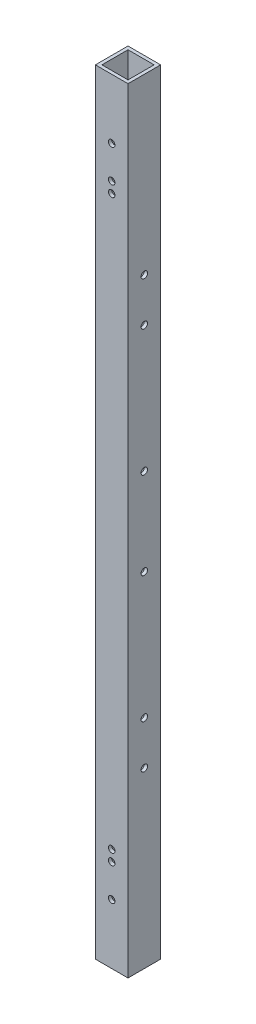
ISO-10303-21;
HEADER;
FILE_DESCRIPTION(('STEP AP214'),'2;1');
FILE_NAME('part.step','',(''),(''),'','','');
FILE_SCHEMA(('AUTOMOTIVE_DESIGN { 1 0 10303 214 1 1 1 1 }'));
ENDSEC;
DATA;
#1=APPLICATION_CONTEXT('core data for automotive mechanical design processes');
#2=APPLICATION_PROTOCOL_DEFINITION('international standard','automotive_design',2000,#1);
#3=PRODUCT_CONTEXT('',#1,'mechanical');
#4=PRODUCT('Part','Part','',(#3));
#5=PRODUCT_RELATED_PRODUCT_CATEGORY('part','',(#4));
#6=PRODUCT_DEFINITION_FORMATION('','',#4);
#7=PRODUCT_DEFINITION_CONTEXT('part definition',#1,'design');
#8=PRODUCT_DEFINITION('design','',#6,#7);
#9=PRODUCT_DEFINITION_SHAPE('','',#8);
#10=(LENGTH_UNIT() NAMED_UNIT(*) SI_UNIT(.MILLI.,.METRE.));
#11=(NAMED_UNIT(*) PLANE_ANGLE_UNIT() SI_UNIT($,.RADIAN.));
#12=(NAMED_UNIT(*) SI_UNIT($,.STERADIAN.) SOLID_ANGLE_UNIT());
#13=UNCERTAINTY_MEASURE_WITH_UNIT(LENGTH_MEASURE(1.E-05),#10,'distance_accuracy_value','');
#14=(GEOMETRIC_REPRESENTATION_CONTEXT(3) GLOBAL_UNCERTAINTY_ASSIGNED_CONTEXT((#13)) GLOBAL_UNIT_ASSIGNED_CONTEXT((#10,
#11,#12)) REPRESENTATION_CONTEXT('',''));
#15=CARTESIAN_POINT('',(0.,0.,0.));
#16=DIRECTION('',(0.,0.,1.));
#17=DIRECTION('',(1.,0.,0.));
#18=AXIS2_PLACEMENT_3D('',#15,#16,#17);
#19=CARTESIAN_POINT('',(0.,356.,0.));
#20=DIRECTION('',(0.,1.,0.));
#21=DIRECTION('',(0.,0.,1.));
#22=AXIS2_PLACEMENT_3D('',#19,#20,#21);
#23=PLANE('',#22);
#24=DIRECTION('',(0.,0.,1.));
#25=VECTOR('',#24,1.);
#26=CARTESIAN_POINT('',(0.,356.,0.));
#27=LINE('',#26,#25);
#28=CARTESIAN_POINT('',(0.,356.,-15.));
#29=VERTEX_POINT('',#28);
#30=CARTESIAN_POINT('',(0.,356.,0.));
#31=VERTEX_POINT('',#30);
#32=EDGE_CURVE('E172',#29,#31,#27,.T.);
#33=ORIENTED_EDGE('',*,*,#32,.T.);
#34=DIRECTION('',(1.,0.,0.));
#35=VECTOR('',#34,1.);
#36=CARTESIAN_POINT('',(0.,356.,0.));
#37=LINE('',#36,#35);
#38=CARTESIAN_POINT('',(15.,356.,0.));
#39=VERTEX_POINT('',#38);
#40=EDGE_CURVE('E175',#31,#39,#37,.T.);
#41=ORIENTED_EDGE('',*,*,#40,.T.);
#42=DIRECTION('',(0.,0.,-1.));
#43=VECTOR('',#42,1.);
#44=CARTESIAN_POINT('',(15.,356.,0.));
#45=LINE('',#44,#43);
#46=CARTESIAN_POINT('',(15.,356.,-15.));
#47=VERTEX_POINT('',#46);
#48=EDGE_CURVE('E178',#39,#47,#45,.T.);
#49=ORIENTED_EDGE('',*,*,#48,.T.);
#50=DIRECTION('',(-1.,0.,0.));
#51=VECTOR('',#50,1.);
#52=CARTESIAN_POINT('',(0.,356.,-15.));
#53=LINE('',#52,#51);
#54=EDGE_CURVE('E180',#47,#29,#53,.T.);
#55=ORIENTED_EDGE('',*,*,#54,.T.);
#56=EDGE_LOOP('',(#33,#41,#49,#55));
#57=FACE_BOUND('',#56,.T.);
#58=DIRECTION('',(1.,0.,0.));
#59=VECTOR('',#58,1.);
#60=CARTESIAN_POINT('',(0.,356.,-1.5));
#61=LINE('',#60,#59);
#62=CARTESIAN_POINT('',(1.5,356.,-1.5));
#63=VERTEX_POINT('',#62);
#64=CARTESIAN_POINT('',(13.5,356.,-1.5));
#65=VERTEX_POINT('',#64);
#66=EDGE_CURVE('E142',#63,#65,#61,.T.);
#67=ORIENTED_EDGE('',*,*,#66,.F.);
#68=DIRECTION('',(0.,0.,1.));
#69=VECTOR('',#68,1.);
#70=CARTESIAN_POINT('',(1.5,356.,0.));
#71=LINE('',#70,#69);
#72=CARTESIAN_POINT('',(1.5,356.,-13.5));
#73=VERTEX_POINT('',#72);
#74=EDGE_CURVE('E134',#73,#63,#71,.T.);
#75=ORIENTED_EDGE('',*,*,#74,.F.);
#76=DIRECTION('',(-1.,0.,0.));
#77=VECTOR('',#76,1.);
#78=CARTESIAN_POINT('',(0.,356.,-13.5));
#79=LINE('',#78,#77);
#80=CARTESIAN_POINT('',(13.5,356.,-13.5));
#81=VERTEX_POINT('',#80);
#82=EDGE_CURVE('E156',#81,#73,#79,.T.);
#83=ORIENTED_EDGE('',*,*,#82,.F.);
#84=DIRECTION('',(0.,0.,-1.));
#85=VECTOR('',#84,1.);
#86=CARTESIAN_POINT('',(13.5,356.,0.));
#87=LINE('',#86,#85);
#88=EDGE_CURVE('E154',#65,#81,#87,.T.);
#89=ORIENTED_EDGE('',*,*,#88,.F.);
#90=EDGE_LOOP('',(#67,#75,#83,#89));
#91=FACE_BOUND('',#90,.T.);
#92=ADVANCED_FACE('F67',(#57,#91),#23,.T.);
#93=CARTESIAN_POINT('',(0.,0.,0.));
#94=DIRECTION('',(0.,1.,0.));
#95=DIRECTION('',(0.,0.,1.));
#96=AXIS2_PLACEMENT_3D('',#93,#94,#95);
#97=PLANE('',#96);
#98=DIRECTION('',(0.,0.,1.));
#99=VECTOR('',#98,1.);
#100=CARTESIAN_POINT('',(0.,0.,0.));
#101=LINE('',#100,#99);
#102=CARTESIAN_POINT('',(0.,0.,-15.));
#103=VERTEX_POINT('',#102);
#104=CARTESIAN_POINT('',(0.,0.,0.));
#105=VERTEX_POINT('',#104);
#106=EDGE_CURVE('E150',#103,#105,#101,.T.);
#107=ORIENTED_EDGE('',*,*,#106,.F.);
#108=DIRECTION('',(-1.,0.,0.));
#109=VECTOR('',#108,1.);
#110=CARTESIAN_POINT('',(0.,0.,-15.));
#111=LINE('',#110,#109);
#112=CARTESIAN_POINT('',(15.,0.,-15.));
#113=VERTEX_POINT('',#112);
#114=EDGE_CURVE('E176',#113,#103,#111,.T.);
#115=ORIENTED_EDGE('',*,*,#114,.F.);
#116=DIRECTION('',(0.,0.,-1.));
#117=VECTOR('',#116,1.);
#118=CARTESIAN_POINT('',(15.,0.,0.));
#119=LINE('',#118,#117);
#120=CARTESIAN_POINT('',(15.,0.,0.));
#121=VERTEX_POINT('',#120);
#122=EDGE_CURVE('E187',#121,#113,#119,.T.);
#123=ORIENTED_EDGE('',*,*,#122,.F.);
#124=DIRECTION('',(1.,0.,0.));
#125=VECTOR('',#124,1.);
#126=CARTESIAN_POINT('',(0.,0.,0.));
#127=LINE('',#126,#125);
#128=EDGE_CURVE('E185',#105,#121,#127,.T.);
#129=ORIENTED_EDGE('',*,*,#128,.F.);
#130=EDGE_LOOP('',(#107,#115,#123,#129));
#131=FACE_BOUND('',#130,.T.);
#132=DIRECTION('',(0.,0.,1.));
#133=VECTOR('',#132,1.);
#134=CARTESIAN_POINT('',(1.5,0.,0.));
#135=LINE('',#134,#133);
#136=CARTESIAN_POINT('',(1.5,0.,-13.5));
#137=VERTEX_POINT('',#136);
#138=CARTESIAN_POINT('',(1.5,0.,-1.5));
#139=VERTEX_POINT('',#138);
#140=EDGE_CURVE('E92',#137,#139,#135,.T.);
#141=ORIENTED_EDGE('',*,*,#140,.T.);
#142=DIRECTION('',(1.,0.,0.));
#143=VECTOR('',#142,1.);
#144=CARTESIAN_POINT('',(0.,0.,-1.5));
#145=LINE('',#144,#143);
#146=CARTESIAN_POINT('',(13.5,0.,-1.5));
#147=VERTEX_POINT('',#146);
#148=EDGE_CURVE('E149',#139,#147,#145,.T.);
#149=ORIENTED_EDGE('',*,*,#148,.T.);
#150=DIRECTION('',(0.,0.,-1.));
#151=VECTOR('',#150,1.);
#152=CARTESIAN_POINT('',(13.5,0.,0.));
#153=LINE('',#152,#151);
#154=CARTESIAN_POINT('',(13.5,0.,-13.5));
#155=VERTEX_POINT('',#154);
#156=EDGE_CURVE('E164',#147,#155,#153,.T.);
#157=ORIENTED_EDGE('',*,*,#156,.T.);
#158=DIRECTION('',(-1.,0.,0.));
#159=VECTOR('',#158,1.);
#160=CARTESIAN_POINT('',(0.,0.,-13.5));
#161=LINE('',#160,#159);
#162=EDGE_CURVE('E143',#155,#137,#161,.T.);
#163=ORIENTED_EDGE('',*,*,#162,.T.);
#164=EDGE_LOOP('',(#141,#149,#157,#163));
#165=FACE_BOUND('',#164,.T.);
#166=ADVANCED_FACE('F341',(#131,#165),#97,.F.);
#167=CARTESIAN_POINT('',(0.,356.,0.));
#168=DIRECTION('',(1.,0.,0.));
#169=DIRECTION('',(0.,0.,-1.));
#170=AXIS2_PLACEMENT_3D('',#167,#168,#169);
#171=PLANE('',#170);
#172=CARTESIAN_POINT('',(0.,276.148,-7.50000000000833));
#173=DIRECTION('',(1.,0.,0.));
#174=DIRECTION('',(0.,0.,-1.));
#175=AXIS2_PLACEMENT_3D('',#172,#173,#174);
#176=CIRCLE('',#175,1.49999999999173);
#177=CARTESIAN_POINT('',(0.,276.148,-9.00000000000006));
#178=VERTEX_POINT('',#177);
#179=EDGE_CURVE('E225',#178,#178,#176,.T.);
#180=ORIENTED_EDGE('',*,*,#179,.T.);
#181=EDGE_LOOP('',(#180));
#182=FACE_BOUND('',#181,.T.);
#183=CARTESIAN_POINT('',(0.,256.148,-7.50000000000833));
#184=DIRECTION('',(1.,0.,0.));
#185=DIRECTION('',(0.,0.,-1.));
#186=AXIS2_PLACEMENT_3D('',#183,#184,#185);
#187=CIRCLE('',#186,1.49999999999152);
#188=CARTESIAN_POINT('',(0.,256.148,-8.99999999999985));
#189=VERTEX_POINT('',#188);
#190=EDGE_CURVE('E429',#189,#189,#187,.T.);
#191=ORIENTED_EDGE('',*,*,#190,.T.);
#192=EDGE_LOOP('',(#191));
#193=FACE_BOUND('',#192,.T.);
#194=CARTESIAN_POINT('',(0.,198.,-7.50000000000833));
#195=DIRECTION('',(1.,0.,0.));
#196=DIRECTION('',(0.,0.,-1.));
#197=AXIS2_PLACEMENT_3D('',#194,#195,#196);
#198=CIRCLE('',#197,1.5);
#199=CARTESIAN_POINT('',(0.,198.,-9.00000000000833));
#200=VERTEX_POINT('',#199);
#201=EDGE_CURVE('E433',#200,#200,#198,.T.);
#202=ORIENTED_EDGE('',*,*,#201,.T.);
#203=EDGE_LOOP('',(#202));
#204=FACE_BOUND('',#203,.T.);
#205=CARTESIAN_POINT('',(0.,158.,-7.50000000000833));
#206=DIRECTION('',(1.,0.,0.));
#207=DIRECTION('',(0.,0.,-1.));
#208=AXIS2_PLACEMENT_3D('',#205,#206,#207);
#209=CIRCLE('',#208,1.5);
#210=CARTESIAN_POINT('',(0.,158.,-9.00000000000833));
#211=VERTEX_POINT('',#210);
#212=EDGE_CURVE('E437',#211,#211,#209,.T.);
#213=ORIENTED_EDGE('',*,*,#212,.T.);
#214=EDGE_LOOP('',(#213));
#215=FACE_BOUND('',#214,.T.);
#216=CARTESIAN_POINT('',(0.,99.8520000000001,-7.50000000000833));
#217=DIRECTION('',(1.,0.,0.));
#218=DIRECTION('',(0.,0.,-1.));
#219=AXIS2_PLACEMENT_3D('',#216,#217,#218);
#220=CIRCLE('',#219,1.50000000000754);
#221=CARTESIAN_POINT('',(0.,99.8520000000001,-9.00000000001586));
#222=VERTEX_POINT('',#221);
#223=EDGE_CURVE('E391',#222,#222,#220,.T.);
#224=ORIENTED_EDGE('',*,*,#223,.T.);
#225=EDGE_LOOP('',(#224));
#226=FACE_BOUND('',#225,.T.);
#227=CARTESIAN_POINT('',(0.,79.8520000000001,-7.50000000000833));
#228=DIRECTION('',(1.,0.,0.));
#229=DIRECTION('',(0.,0.,-1.));
#230=AXIS2_PLACEMENT_3D('',#227,#228,#229);
#231=CIRCLE('',#230,1.50000000000775);
#232=CARTESIAN_POINT('',(0.,79.8520000000001,-9.00000000001608));
#233=VERTEX_POINT('',#232);
#234=EDGE_CURVE('E392',#233,#233,#231,.T.);
#235=ORIENTED_EDGE('',*,*,#234,.T.);
#236=EDGE_LOOP('',(#235));
#237=FACE_BOUND('',#236,.T.);
#238=ORIENTED_EDGE('',*,*,#106,.T.);
#239=DIRECTION('',(0.,-1.,0.));
#240=VECTOR('',#239,1.);
#241=CARTESIAN_POINT('',(0.,356.,0.));
#242=LINE('',#241,#240);
#243=EDGE_CURVE('E12',#31,#105,#242,.T.);
#244=ORIENTED_EDGE('',*,*,#243,.F.);
#245=ORIENTED_EDGE('',*,*,#32,.F.);
#246=DIRECTION('',(0.,-1.,0.));
#247=VECTOR('',#246,1.);
#248=CARTESIAN_POINT('',(0.,356.,-15.));
#249=LINE('',#248,#247);
#250=EDGE_CURVE('E182',#29,#103,#249,.T.);
#251=ORIENTED_EDGE('',*,*,#250,.T.);
#252=EDGE_LOOP('',(#238,#244,#245,#251));
#253=FACE_BOUND('',#252,.T.);
#254=ADVANCED_FACE('F69',(#182,#193,#204,#215,#226,#237,#253),#171,.F.);
#255=CARTESIAN_POINT('',(0.,356.,0.));
#256=DIRECTION('',(0.,0.,-1.));
#257=DIRECTION('',(-1.,0.,0.));
#258=AXIS2_PLACEMENT_3D('',#255,#256,#257);
#259=PLANE('',#258);
#260=CARTESIAN_POINT('',(7.49999999999842,27.5000000000018,0.));
#261=DIRECTION('',(0.,0.,1.));
#262=DIRECTION('',(1.,0.,0.));
#263=AXIS2_PLACEMENT_3D('',#260,#261,#262);
#264=CIRCLE('',#263,1.5);
#265=CARTESIAN_POINT('',(8.99999999999842,27.5000000000018,0.));
#266=VERTEX_POINT('',#265);
#267=EDGE_CURVE('E257',#266,#266,#264,.T.);
#268=ORIENTED_EDGE('',*,*,#267,.F.);
#269=EDGE_LOOP('',(#268));
#270=FACE_BOUND('',#269,.T.);
#271=CARTESIAN_POINT('',(7.49999999999864,308.499999999998,0.));
#272=DIRECTION('',(0.,0.,1.));
#273=DIRECTION('',(-1.,0.,0.));
#274=AXIS2_PLACEMENT_3D('',#271,#272,#273);
#275=CIRCLE('',#274,1.5);
#276=CARTESIAN_POINT('',(5.99999999999864,308.499999999998,0.));
#277=VERTEX_POINT('',#276);
#278=EDGE_CURVE('E261',#277,#277,#275,.T.);
#279=ORIENTED_EDGE('',*,*,#278,.F.);
#280=EDGE_LOOP('',(#279));
#281=FACE_BOUND('',#280,.T.);
#282=CARTESIAN_POINT('',(7.49999999999977,313.5,0.));
#283=DIRECTION('',(0.,0.,1.));
#284=DIRECTION('',(-1.,0.,0.));
#285=AXIS2_PLACEMENT_3D('',#282,#283,#284);
#286=CIRCLE('',#285,1.5);
#287=CARTESIAN_POINT('',(5.99999999999977,313.5,0.));
#288=VERTEX_POINT('',#287);
#289=EDGE_CURVE('E284',#288,#288,#286,.T.);
#290=ORIENTED_EDGE('',*,*,#289,.F.);
#291=EDGE_LOOP('',(#290));
#292=FACE_BOUND('',#291,.T.);
#293=CARTESIAN_POINT('',(7.49999999999842,328.499999999998,0.));
#294=DIRECTION('',(0.,0.,1.));
#295=DIRECTION('',(-1.,0.,0.));
#296=AXIS2_PLACEMENT_3D('',#293,#294,#295);
#297=CIRCLE('',#296,1.5);
#298=CARTESIAN_POINT('',(5.99999999999842,328.499999999998,0.));
#299=VERTEX_POINT('',#298);
#300=EDGE_CURVE('E278',#299,#299,#297,.T.);
#301=ORIENTED_EDGE('',*,*,#300,.F.);
#302=EDGE_LOOP('',(#301));
#303=FACE_BOUND('',#302,.T.);
#304=CARTESIAN_POINT('',(7.49999999999977,42.5,0.));
#305=DIRECTION('',(0.,0.,1.));
#306=DIRECTION('',(1.,0.,0.));
#307=AXIS2_PLACEMENT_3D('',#304,#305,#306);
#308=CIRCLE('',#307,1.5);
#309=CARTESIAN_POINT('',(8.99999999999977,42.5,0.));
#310=VERTEX_POINT('',#309);
#311=EDGE_CURVE('E272',#310,#310,#308,.T.);
#312=ORIENTED_EDGE('',*,*,#311,.F.);
#313=EDGE_LOOP('',(#312));
#314=FACE_BOUND('',#313,.T.);
#315=CARTESIAN_POINT('',(7.49999999999864,47.5000000000017,0.));
#316=DIRECTION('',(0.,0.,1.));
#317=DIRECTION('',(1.,0.,0.));
#318=AXIS2_PLACEMENT_3D('',#315,#316,#317);
#319=CIRCLE('',#318,1.5);
#320=CARTESIAN_POINT('',(8.99999999999864,47.5000000000017,0.));
#321=VERTEX_POINT('',#320);
#322=EDGE_CURVE('E260',#321,#321,#319,.T.);
#323=ORIENTED_EDGE('',*,*,#322,.F.);
#324=EDGE_LOOP('',(#323));
#325=FACE_BOUND('',#324,.T.);
#326=ORIENTED_EDGE('',*,*,#128,.T.);
#327=DIRECTION('',(0.,-1.,0.));
#328=VECTOR('',#327,1.);
#329=CARTESIAN_POINT('',(15.,356.,0.));
#330=LINE('',#329,#328);
#331=EDGE_CURVE('E76',#39,#121,#330,.T.);
#332=ORIENTED_EDGE('',*,*,#331,.F.);
#333=ORIENTED_EDGE('',*,*,#40,.F.);
#334=ORIENTED_EDGE('',*,*,#243,.T.);
#335=EDGE_LOOP('',(#326,#332,#333,#334));
#336=FACE_BOUND('',#335,.T.);
#337=ADVANCED_FACE('F327',(#270,#281,#292,#303,#314,#325,#336),#259,.F.);
#338=CARTESIAN_POINT('',(15.,356.,0.));
#339=DIRECTION('',(-1.,0.,0.));
#340=DIRECTION('',(0.,0.,1.));
#341=AXIS2_PLACEMENT_3D('',#338,#339,#340);
#342=PLANE('',#341);
#343=CARTESIAN_POINT('',(15.,276.148,-7.50000000000833));
#344=DIRECTION('',(1.,0.,0.));
#345=DIRECTION('',(0.,0.,-1.));
#346=AXIS2_PLACEMENT_3D('',#343,#344,#345);
#347=CIRCLE('',#346,1.49999999999173);
#348=CARTESIAN_POINT('',(15.,276.148,-9.00000000000006));
#349=VERTEX_POINT('',#348);
#350=EDGE_CURVE('E370',#349,#349,#347,.T.);
#351=ORIENTED_EDGE('',*,*,#350,.F.);
#352=EDGE_LOOP('',(#351));
#353=FACE_BOUND('',#352,.T.);
#354=CARTESIAN_POINT('',(15.,256.148,-7.50000000000833));
#355=DIRECTION('',(1.,0.,0.));
#356=DIRECTION('',(0.,0.,-1.));
#357=AXIS2_PLACEMENT_3D('',#354,#355,#356);
#358=CIRCLE('',#357,1.49999999999152);
#359=CARTESIAN_POINT('',(15.,256.148,-8.99999999999985));
#360=VERTEX_POINT('',#359);
#361=EDGE_CURVE('E374',#360,#360,#358,.T.);
#362=ORIENTED_EDGE('',*,*,#361,.F.);
#363=EDGE_LOOP('',(#362));
#364=FACE_BOUND('',#363,.T.);
#365=CARTESIAN_POINT('',(15.,198.,-7.50000000000833));
#366=DIRECTION('',(1.,0.,0.));
#367=DIRECTION('',(0.,0.,-1.));
#368=AXIS2_PLACEMENT_3D('',#365,#366,#367);
#369=CIRCLE('',#368,1.5);
#370=CARTESIAN_POINT('',(15.,198.,-9.00000000000833));
#371=VERTEX_POINT('',#370);
#372=EDGE_CURVE('E378',#371,#371,#369,.T.);
#373=ORIENTED_EDGE('',*,*,#372,.F.);
#374=EDGE_LOOP('',(#373));
#375=FACE_BOUND('',#374,.T.);
#376=CARTESIAN_POINT('',(15.,158.,-7.50000000000833));
#377=DIRECTION('',(1.,0.,0.));
#378=DIRECTION('',(0.,0.,-1.));
#379=AXIS2_PLACEMENT_3D('',#376,#377,#378);
#380=CIRCLE('',#379,1.5);
#381=CARTESIAN_POINT('',(15.,158.,-9.00000000000833));
#382=VERTEX_POINT('',#381);
#383=EDGE_CURVE('E382',#382,#382,#380,.T.);
#384=ORIENTED_EDGE('',*,*,#383,.F.);
#385=EDGE_LOOP('',(#384));
#386=FACE_BOUND('',#385,.T.);
#387=CARTESIAN_POINT('',(15.,99.8520000000001,-7.50000000000833));
#388=DIRECTION('',(1.,0.,0.));
#389=DIRECTION('',(0.,0.,-1.));
#390=AXIS2_PLACEMENT_3D('',#387,#388,#389);
#391=CIRCLE('',#390,1.50000000000754);
#392=CARTESIAN_POINT('',(15.,99.8520000000001,-9.00000000001586));
#393=VERTEX_POINT('',#392);
#394=EDGE_CURVE('E386',#393,#393,#391,.T.);
#395=ORIENTED_EDGE('',*,*,#394,.F.);
#396=EDGE_LOOP('',(#395));
#397=FACE_BOUND('',#396,.T.);
#398=CARTESIAN_POINT('',(15.,79.8520000000001,-7.50000000000833));
#399=DIRECTION('',(1.,0.,0.));
#400=DIRECTION('',(0.,0.,-1.));
#401=AXIS2_PLACEMENT_3D('',#398,#399,#400);
#402=CIRCLE('',#401,1.50000000000775);
#403=CARTESIAN_POINT('',(15.,79.8520000000001,-9.00000000001608));
#404=VERTEX_POINT('',#403);
#405=EDGE_CURVE('E389',#404,#404,#402,.T.);
#406=ORIENTED_EDGE('',*,*,#405,.F.);
#407=EDGE_LOOP('',(#406));
#408=FACE_BOUND('',#407,.T.);
#409=ORIENTED_EDGE('',*,*,#122,.T.);
#410=DIRECTION('',(0.,-1.,0.));
#411=VECTOR('',#410,1.);
#412=CARTESIAN_POINT('',(15.,356.,-15.));
#413=LINE('',#412,#411);
#414=EDGE_CURVE('E192',#47,#113,#413,.T.);
#415=ORIENTED_EDGE('',*,*,#414,.F.);
#416=ORIENTED_EDGE('',*,*,#48,.F.);
#417=ORIENTED_EDGE('',*,*,#331,.T.);
#418=EDGE_LOOP('',(#409,#415,#416,#417));
#419=FACE_BOUND('',#418,.T.);
#420=ADVANCED_FACE('F330',(#353,#364,#375,#386,#397,#408,#419),#342,.F.);
#421=CARTESIAN_POINT('',(0.,356.,-15.));
#422=DIRECTION('',(0.,0.,1.));
#423=DIRECTION('',(1.,0.,0.));
#424=AXIS2_PLACEMENT_3D('',#421,#422,#423);
#425=PLANE('',#424);
#426=CARTESIAN_POINT('',(7.49999999999842,27.5000000000018,-15.));
#427=DIRECTION('',(0.,0.,1.));
#428=DIRECTION('',(1.,0.,0.));
#429=AXIS2_PLACEMENT_3D('',#426,#427,#428);
#430=CIRCLE('',#429,1.5);
#431=CARTESIAN_POINT('',(8.99999999999842,27.5000000000018,-15.));
#432=VERTEX_POINT('',#431);
#433=EDGE_CURVE('E201',#432,#432,#430,.T.);
#434=ORIENTED_EDGE('',*,*,#433,.T.);
#435=EDGE_LOOP('',(#434));
#436=FACE_BOUND('',#435,.T.);
#437=CARTESIAN_POINT('',(7.49999999999864,308.499999999998,-15.));
#438=DIRECTION('',(0.,0.,1.));
#439=DIRECTION('',(-1.,0.,0.));
#440=AXIS2_PLACEMENT_3D('',#437,#438,#439);
#441=CIRCLE('',#440,1.5);
#442=CARTESIAN_POINT('',(5.99999999999864,308.499999999998,-15.));
#443=VERTEX_POINT('',#442);
#444=EDGE_CURVE('E254',#443,#443,#441,.T.);
#445=ORIENTED_EDGE('',*,*,#444,.T.);
#446=EDGE_LOOP('',(#445));
#447=FACE_BOUND('',#446,.T.);
#448=CARTESIAN_POINT('',(7.49999999999977,313.5,-15.));
#449=DIRECTION('',(0.,0.,1.));
#450=DIRECTION('',(-1.,0.,0.));
#451=AXIS2_PLACEMENT_3D('',#448,#449,#450);
#452=CIRCLE('',#451,1.5);
#453=CARTESIAN_POINT('',(5.99999999999977,313.5,-15.));
#454=VERTEX_POINT('',#453);
#455=EDGE_CURVE('E264',#454,#454,#452,.T.);
#456=ORIENTED_EDGE('',*,*,#455,.T.);
#457=EDGE_LOOP('',(#456));
#458=FACE_BOUND('',#457,.T.);
#459=CARTESIAN_POINT('',(7.49999999999842,328.499999999998,-15.));
#460=DIRECTION('',(0.,0.,1.));
#461=DIRECTION('',(-1.,0.,0.));
#462=AXIS2_PLACEMENT_3D('',#459,#460,#461);
#463=CIRCLE('',#462,1.5);
#464=CARTESIAN_POINT('',(5.99999999999842,328.499999999998,-15.));
#465=VERTEX_POINT('',#464);
#466=EDGE_CURVE('E281',#465,#465,#463,.T.);
#467=ORIENTED_EDGE('',*,*,#466,.T.);
#468=EDGE_LOOP('',(#467));
#469=FACE_BOUND('',#468,.T.);
#470=CARTESIAN_POINT('',(7.49999999999977,42.5,-15.));
#471=DIRECTION('',(0.,0.,1.));
#472=DIRECTION('',(1.,0.,0.));
#473=AXIS2_PLACEMENT_3D('',#470,#471,#472);
#474=CIRCLE('',#473,1.5);
#475=CARTESIAN_POINT('',(8.99999999999977,42.5,-15.));
#476=VERTEX_POINT('',#475);
#477=EDGE_CURVE('E275',#476,#476,#474,.T.);
#478=ORIENTED_EDGE('',*,*,#477,.T.);
#479=EDGE_LOOP('',(#478));
#480=FACE_BOUND('',#479,.T.);
#481=CARTESIAN_POINT('',(7.49999999999864,47.5000000000017,-15.));
#482=DIRECTION('',(0.,0.,1.));
#483=DIRECTION('',(1.,0.,0.));
#484=AXIS2_PLACEMENT_3D('',#481,#482,#483);
#485=CIRCLE('',#484,1.5);
#486=CARTESIAN_POINT('',(8.99999999999864,47.5000000000017,-15.));
#487=VERTEX_POINT('',#486);
#488=EDGE_CURVE('E269',#487,#487,#485,.T.);
#489=ORIENTED_EDGE('',*,*,#488,.T.);
#490=EDGE_LOOP('',(#489));
#491=FACE_BOUND('',#490,.T.);
#492=ORIENTED_EDGE('',*,*,#114,.T.);
#493=ORIENTED_EDGE('',*,*,#250,.F.);
#494=ORIENTED_EDGE('',*,*,#54,.F.);
#495=ORIENTED_EDGE('',*,*,#414,.T.);
#496=EDGE_LOOP('',(#492,#493,#494,#495));
#497=FACE_BOUND('',#496,.T.);
#498=ADVANCED_FACE('F345',(#436,#447,#458,#469,#480,#491,#497),#425,.F.);
#499=CARTESIAN_POINT('',(1.5,356.,0.));
#500=DIRECTION('',(1.,0.,0.));
#501=DIRECTION('',(0.,0.,-1.));
#502=AXIS2_PLACEMENT_3D('',#499,#500,#501);
#503=PLANE('',#502);
#504=CARTESIAN_POINT('',(1.5,276.148,-7.50000000000833));
#505=DIRECTION('',(1.,0.,0.));
#506=DIRECTION('',(0.,0.,-1.));
#507=AXIS2_PLACEMENT_3D('',#504,#505,#506);
#508=CIRCLE('',#507,1.49999999999173);
#509=CARTESIAN_POINT('',(1.5,276.148,-9.00000000000006));
#510=VERTEX_POINT('',#509);
#511=EDGE_CURVE('E251',#510,#510,#508,.T.);
#512=ORIENTED_EDGE('',*,*,#511,.F.);
#513=EDGE_LOOP('',(#512));
#514=FACE_BOUND('',#513,.T.);
#515=CARTESIAN_POINT('',(1.5,256.148,-7.50000000000833));
#516=DIRECTION('',(1.,0.,0.));
#517=DIRECTION('',(0.,0.,-1.));
#518=AXIS2_PLACEMENT_3D('',#515,#516,#517);
#519=CIRCLE('',#518,1.49999999999152);
#520=CARTESIAN_POINT('',(1.5,256.148,-8.99999999999985));
#521=VERTEX_POINT('',#520);
#522=EDGE_CURVE('E239',#521,#521,#519,.T.);
#523=ORIENTED_EDGE('',*,*,#522,.F.);
#524=EDGE_LOOP('',(#523));
#525=FACE_BOUND('',#524,.T.);
#526=CARTESIAN_POINT('',(1.5,198.,-7.50000000000833));
#527=DIRECTION('',(1.,0.,0.));
#528=DIRECTION('',(0.,0.,-1.));
#529=AXIS2_PLACEMENT_3D('',#526,#527,#528);
#530=CIRCLE('',#529,1.5);
#531=CARTESIAN_POINT('',(1.5,198.,-9.00000000000833));
#532=VERTEX_POINT('',#531);
#533=EDGE_CURVE('E236',#532,#532,#530,.T.);
#534=ORIENTED_EDGE('',*,*,#533,.F.);
#535=EDGE_LOOP('',(#534));
#536=FACE_BOUND('',#535,.T.);
#537=CARTESIAN_POINT('',(1.5,158.,-7.50000000000833));
#538=DIRECTION('',(1.,0.,0.));
#539=DIRECTION('',(0.,0.,-1.));
#540=AXIS2_PLACEMENT_3D('',#537,#538,#539);
#541=CIRCLE('',#540,1.5);
#542=CARTESIAN_POINT('',(1.5,158.,-9.00000000000833));
#543=VERTEX_POINT('',#542);
#544=EDGE_CURVE('E233',#543,#543,#541,.T.);
#545=ORIENTED_EDGE('',*,*,#544,.F.);
#546=EDGE_LOOP('',(#545));
#547=FACE_BOUND('',#546,.T.);
#548=CARTESIAN_POINT('',(1.5,99.8520000000001,-7.50000000000833));
#549=DIRECTION('',(1.,0.,0.));
#550=DIRECTION('',(0.,0.,-1.));
#551=AXIS2_PLACEMENT_3D('',#548,#549,#550);
#552=CIRCLE('',#551,1.50000000000754);
#553=CARTESIAN_POINT('',(1.5,99.8520000000001,-9.00000000001586));
#554=VERTEX_POINT('',#553);
#555=EDGE_CURVE('E229',#554,#554,#552,.T.);
#556=ORIENTED_EDGE('',*,*,#555,.F.);
#557=EDGE_LOOP('',(#556));
#558=FACE_BOUND('',#557,.T.);
#559=CARTESIAN_POINT('',(1.5,79.8520000000001,-7.50000000000833));
#560=DIRECTION('',(1.,0.,0.));
#561=DIRECTION('',(0.,0.,-1.));
#562=AXIS2_PLACEMENT_3D('',#559,#560,#561);
#563=CIRCLE('',#562,1.50000000000775);
#564=CARTESIAN_POINT('',(1.5,79.8520000000001,-9.00000000001608));
#565=VERTEX_POINT('',#564);
#566=EDGE_CURVE('E224',#565,#565,#563,.T.);
#567=ORIENTED_EDGE('',*,*,#566,.F.);
#568=EDGE_LOOP('',(#567));
#569=FACE_BOUND('',#568,.T.);
#570=ORIENTED_EDGE('',*,*,#140,.F.);
#571=DIRECTION('',(0.,-1.,0.));
#572=VECTOR('',#571,1.);
#573=CARTESIAN_POINT('',(1.5,356.,-13.5));
#574=LINE('',#573,#572);
#575=EDGE_CURVE('E138',#73,#137,#574,.T.);
#576=ORIENTED_EDGE('',*,*,#575,.F.);
#577=ORIENTED_EDGE('',*,*,#74,.T.);
#578=DIRECTION('',(0.,-1.,0.));
#579=VECTOR('',#578,1.);
#580=CARTESIAN_POINT('',(1.5,356.,-1.5));
#581=LINE('',#580,#579);
#582=EDGE_CURVE('E137',#63,#139,#581,.T.);
#583=ORIENTED_EDGE('',*,*,#582,.T.);
#584=EDGE_LOOP('',(#570,#576,#577,#583));
#585=FACE_BOUND('',#584,.T.);
#586=ADVANCED_FACE('F136',(#514,#525,#536,#547,#558,#569,#585),#503,.T.);
#587=CARTESIAN_POINT('',(0.,356.,-1.5));
#588=DIRECTION('',(0.,0.,-1.));
#589=DIRECTION('',(-1.,0.,0.));
#590=AXIS2_PLACEMENT_3D('',#587,#588,#589);
#591=PLANE('',#590);
#592=CARTESIAN_POINT('',(7.49999999999842,27.5000000000018,-1.5));
#593=DIRECTION('',(0.,0.,-1.));
#594=DIRECTION('',(-1.,0.,0.));
#595=AXIS2_PLACEMENT_3D('',#592,#593,#594);
#596=CIRCLE('',#595,1.5);
#597=CARTESIAN_POINT('',(5.99999999999842,27.5000000000018,-1.5));
#598=VERTEX_POINT('',#597);
#599=EDGE_CURVE('E162',#598,#598,#596,.T.);
#600=ORIENTED_EDGE('',*,*,#599,.F.);
#601=EDGE_LOOP('',(#600));
#602=FACE_BOUND('',#601,.T.);
#603=CARTESIAN_POINT('',(7.49999999999864,308.499999999998,-1.5));
#604=DIRECTION('',(0.,0.,-1.));
#605=DIRECTION('',(-1.,0.,0.));
#606=AXIS2_PLACEMENT_3D('',#603,#604,#605);
#607=CIRCLE('',#606,1.5);
#608=CARTESIAN_POINT('',(5.99999999999864,308.499999999998,-1.5));
#609=VERTEX_POINT('',#608);
#610=EDGE_CURVE('E217',#609,#609,#607,.T.);
#611=ORIENTED_EDGE('',*,*,#610,.F.);
#612=EDGE_LOOP('',(#611));
#613=FACE_BOUND('',#612,.T.);
#614=CARTESIAN_POINT('',(7.49999999999977,313.5,-1.5));
#615=DIRECTION('',(0.,0.,-1.));
#616=DIRECTION('',(-1.,0.,0.));
#617=AXIS2_PLACEMENT_3D('',#614,#615,#616);
#618=CIRCLE('',#617,1.5);
#619=CARTESIAN_POINT('',(5.99999999999977,313.5,-1.5));
#620=VERTEX_POINT('',#619);
#621=EDGE_CURVE('E213',#620,#620,#618,.T.);
#622=ORIENTED_EDGE('',*,*,#621,.F.);
#623=EDGE_LOOP('',(#622));
#624=FACE_BOUND('',#623,.T.);
#625=CARTESIAN_POINT('',(7.49999999999842,328.499999999998,-1.5));
#626=DIRECTION('',(0.,0.,-1.));
#627=DIRECTION('',(-1.,0.,0.));
#628=AXIS2_PLACEMENT_3D('',#625,#626,#627);
#629=CIRCLE('',#628,1.5);
#630=CARTESIAN_POINT('',(5.99999999999842,328.499999999998,-1.5));
#631=VERTEX_POINT('',#630);
#632=EDGE_CURVE('E209',#631,#631,#629,.T.);
#633=ORIENTED_EDGE('',*,*,#632,.F.);
#634=EDGE_LOOP('',(#633));
#635=FACE_BOUND('',#634,.T.);
#636=CARTESIAN_POINT('',(7.49999999999977,42.5,-1.5));
#637=DIRECTION('',(0.,0.,-1.));
#638=DIRECTION('',(-1.,0.,0.));
#639=AXIS2_PLACEMENT_3D('',#636,#637,#638);
#640=CIRCLE('',#639,1.5);
#641=CARTESIAN_POINT('',(5.99999999999977,42.5,-1.5));
#642=VERTEX_POINT('',#641);
#643=EDGE_CURVE('E205',#642,#642,#640,.T.);
#644=ORIENTED_EDGE('',*,*,#643,.F.);
#645=EDGE_LOOP('',(#644));
#646=FACE_BOUND('',#645,.T.);
#647=CARTESIAN_POINT('',(7.49999999999864,47.5000000000017,-1.5));
#648=DIRECTION('',(0.,0.,-1.));
#649=DIRECTION('',(-1.,0.,0.));
#650=AXIS2_PLACEMENT_3D('',#647,#648,#649);
#651=CIRCLE('',#650,1.5);
#652=CARTESIAN_POINT('',(5.99999999999864,47.5000000000017,-1.5));
#653=VERTEX_POINT('',#652);
#654=EDGE_CURVE('E200',#653,#653,#651,.T.);
#655=ORIENTED_EDGE('',*,*,#654,.F.);
#656=EDGE_LOOP('',(#655));
#657=FACE_BOUND('',#656,.T.);
#658=ORIENTED_EDGE('',*,*,#148,.F.);
#659=ORIENTED_EDGE('',*,*,#582,.F.);
#660=ORIENTED_EDGE('',*,*,#66,.T.);
#661=DIRECTION('',(0.,-1.,0.));
#662=VECTOR('',#661,1.);
#663=CARTESIAN_POINT('',(13.5,356.,-1.5));
#664=LINE('',#663,#662);
#665=EDGE_CURVE('E151',#65,#147,#664,.T.);
#666=ORIENTED_EDGE('',*,*,#665,.T.);
#667=EDGE_LOOP('',(#658,#659,#660,#666));
#668=FACE_BOUND('',#667,.T.);
#669=ADVANCED_FACE('F146',(#602,#613,#624,#635,#646,#657,#668),#591,.T.);
#670=CARTESIAN_POINT('',(13.5,356.,0.));
#671=DIRECTION('',(-1.,0.,0.));
#672=DIRECTION('',(0.,0.,1.));
#673=AXIS2_PLACEMENT_3D('',#670,#671,#672);
#674=PLANE('',#673);
#675=CARTESIAN_POINT('',(13.5,276.148,-7.50000000000833));
#676=DIRECTION('',(-1.,0.,0.));
#677=DIRECTION('',(0.,0.,1.));
#678=AXIS2_PLACEMENT_3D('',#675,#676,#677);
#679=CIRCLE('',#678,1.49999999999173);
#680=CARTESIAN_POINT('',(13.5,276.148,-6.0000000000166));
#681=VERTEX_POINT('',#680);
#682=EDGE_CURVE('E71',#681,#681,#679,.T.);
#683=ORIENTED_EDGE('',*,*,#682,.F.);
#684=EDGE_LOOP('',(#683));
#685=FACE_BOUND('',#684,.T.);
#686=CARTESIAN_POINT('',(13.5,256.148,-7.50000000000833));
#687=DIRECTION('',(-1.,0.,0.));
#688=DIRECTION('',(0.,0.,1.));
#689=AXIS2_PLACEMENT_3D('',#686,#687,#688);
#690=CIRCLE('',#689,1.49999999999152);
#691=CARTESIAN_POINT('',(13.5,256.148,-6.00000000001681));
#692=VERTEX_POINT('',#691);
#693=EDGE_CURVE('E237',#692,#692,#690,.T.);
#694=ORIENTED_EDGE('',*,*,#693,.F.);
#695=EDGE_LOOP('',(#694));
#696=FACE_BOUND('',#695,.T.);
#697=CARTESIAN_POINT('',(13.5,198.,-7.50000000000833));
#698=DIRECTION('',(-1.,0.,0.));
#699=DIRECTION('',(0.,0.,1.));
#700=AXIS2_PLACEMENT_3D('',#697,#698,#699);
#701=CIRCLE('',#700,1.5);
#702=CARTESIAN_POINT('',(13.5,198.,-6.00000000000833));
#703=VERTEX_POINT('',#702);
#704=EDGE_CURVE('E234',#703,#703,#701,.T.);
#705=ORIENTED_EDGE('',*,*,#704,.F.);
#706=EDGE_LOOP('',(#705));
#707=FACE_BOUND('',#706,.T.);
#708=CARTESIAN_POINT('',(13.5,158.,-7.50000000000833));
#709=DIRECTION('',(-1.,0.,0.));
#710=DIRECTION('',(0.,0.,1.));
#711=AXIS2_PLACEMENT_3D('',#708,#709,#710);
#712=CIRCLE('',#711,1.5);
#713=CARTESIAN_POINT('',(13.5,158.,-6.00000000000833));
#714=VERTEX_POINT('',#713);
#715=EDGE_CURVE('E230',#714,#714,#712,.T.);
#716=ORIENTED_EDGE('',*,*,#715,.F.);
#717=EDGE_LOOP('',(#716));
#718=FACE_BOUND('',#717,.T.);
#719=CARTESIAN_POINT('',(13.5,99.8520000000001,-7.50000000000833));
#720=DIRECTION('',(-1.,0.,0.));
#721=DIRECTION('',(0.,0.,1.));
#722=AXIS2_PLACEMENT_3D('',#719,#720,#721);
#723=CIRCLE('',#722,1.50000000000754);
#724=CARTESIAN_POINT('',(13.5,99.8520000000001,-6.00000000000079));
#725=VERTEX_POINT('',#724);
#726=EDGE_CURVE('E226',#725,#725,#723,.T.);
#727=ORIENTED_EDGE('',*,*,#726,.F.);
#728=EDGE_LOOP('',(#727));
#729=FACE_BOUND('',#728,.T.);
#730=CARTESIAN_POINT('',(13.5,79.8520000000001,-7.50000000000833));
#731=DIRECTION('',(-1.,0.,0.));
#732=DIRECTION('',(0.,0.,1.));
#733=AXIS2_PLACEMENT_3D('',#730,#731,#732);
#734=CIRCLE('',#733,1.50000000000775);
#735=CARTESIAN_POINT('',(13.5,79.8520000000001,-6.00000000000058));
#736=VERTEX_POINT('',#735);
#737=EDGE_CURVE('E221',#736,#736,#734,.T.);
#738=ORIENTED_EDGE('',*,*,#737,.F.);
#739=EDGE_LOOP('',(#738));
#740=FACE_BOUND('',#739,.T.);
#741=ORIENTED_EDGE('',*,*,#156,.F.);
#742=ORIENTED_EDGE('',*,*,#665,.F.);
#743=ORIENTED_EDGE('',*,*,#88,.T.);
#744=DIRECTION('',(0.,-1.,0.));
#745=VECTOR('',#744,1.);
#746=CARTESIAN_POINT('',(13.5,356.,-13.5));
#747=LINE('',#746,#745);
#748=EDGE_CURVE('E84',#81,#155,#747,.T.);
#749=ORIENTED_EDGE('',*,*,#748,.T.);
#750=EDGE_LOOP('',(#741,#742,#743,#749));
#751=FACE_BOUND('',#750,.T.);
#752=ADVANCED_FACE('F306',(#685,#696,#707,#718,#729,#740,#751),#674,.T.);
#753=CARTESIAN_POINT('',(0.,356.,-13.5));
#754=DIRECTION('',(0.,0.,1.));
#755=DIRECTION('',(1.,0.,0.));
#756=AXIS2_PLACEMENT_3D('',#753,#754,#755);
#757=PLANE('',#756);
#758=CARTESIAN_POINT('',(7.49999999999842,27.5000000000018,-13.5));
#759=DIRECTION('',(0.,0.,1.));
#760=DIRECTION('',(1.,0.,0.));
#761=AXIS2_PLACEMENT_3D('',#758,#759,#760);
#762=CIRCLE('',#761,1.5);
#763=CARTESIAN_POINT('',(8.99999999999842,27.5000000000018,-13.5));
#764=VERTEX_POINT('',#763);
#765=EDGE_CURVE('E218',#764,#764,#762,.T.);
#766=ORIENTED_EDGE('',*,*,#765,.F.);
#767=EDGE_LOOP('',(#766));
#768=FACE_BOUND('',#767,.T.);
#769=CARTESIAN_POINT('',(7.49999999999864,308.499999999998,-13.5));
#770=DIRECTION('',(0.,0.,1.));
#771=DIRECTION('',(1.,0.,0.));
#772=AXIS2_PLACEMENT_3D('',#769,#770,#771);
#773=CIRCLE('',#772,1.5);
#774=CARTESIAN_POINT('',(8.99999999999864,308.499999999998,-13.5));
#775=VERTEX_POINT('',#774);
#776=EDGE_CURVE('E214',#775,#775,#773,.T.);
#777=ORIENTED_EDGE('',*,*,#776,.F.);
#778=EDGE_LOOP('',(#777));
#779=FACE_BOUND('',#778,.T.);
#780=CARTESIAN_POINT('',(7.49999999999977,313.5,-13.5));
#781=DIRECTION('',(0.,0.,1.));
#782=DIRECTION('',(1.,0.,0.));
#783=AXIS2_PLACEMENT_3D('',#780,#781,#782);
#784=CIRCLE('',#783,1.5);
#785=CARTESIAN_POINT('',(8.99999999999977,313.5,-13.5));
#786=VERTEX_POINT('',#785);
#787=EDGE_CURVE('E210',#786,#786,#784,.T.);
#788=ORIENTED_EDGE('',*,*,#787,.F.);
#789=EDGE_LOOP('',(#788));
#790=FACE_BOUND('',#789,.T.);
#791=CARTESIAN_POINT('',(7.49999999999842,328.499999999998,-13.5));
#792=DIRECTION('',(0.,0.,1.));
#793=DIRECTION('',(1.,0.,0.));
#794=AXIS2_PLACEMENT_3D('',#791,#792,#793);
#795=CIRCLE('',#794,1.5);
#796=CARTESIAN_POINT('',(8.99999999999842,328.499999999998,-13.5));
#797=VERTEX_POINT('',#796);
#798=EDGE_CURVE('E206',#797,#797,#795,.T.);
#799=ORIENTED_EDGE('',*,*,#798,.F.);
#800=EDGE_LOOP('',(#799));
#801=FACE_BOUND('',#800,.T.);
#802=CARTESIAN_POINT('',(7.49999999999977,42.5,-13.5));
#803=DIRECTION('',(0.,0.,1.));
#804=DIRECTION('',(1.,0.,0.));
#805=AXIS2_PLACEMENT_3D('',#802,#803,#804);
#806=CIRCLE('',#805,1.5);
#807=CARTESIAN_POINT('',(8.99999999999977,42.5,-13.5));
#808=VERTEX_POINT('',#807);
#809=EDGE_CURVE('E202',#808,#808,#806,.T.);
#810=ORIENTED_EDGE('',*,*,#809,.F.);
#811=EDGE_LOOP('',(#810));
#812=FACE_BOUND('',#811,.T.);
#813=CARTESIAN_POINT('',(7.49999999999864,47.5000000000017,-13.5));
#814=DIRECTION('',(0.,0.,1.));
#815=DIRECTION('',(1.,0.,0.));
#816=AXIS2_PLACEMENT_3D('',#813,#814,#815);
#817=CIRCLE('',#816,1.5);
#818=CARTESIAN_POINT('',(8.99999999999864,47.5000000000017,-13.5));
#819=VERTEX_POINT('',#818);
#820=EDGE_CURVE('E197',#819,#819,#817,.T.);
#821=ORIENTED_EDGE('',*,*,#820,.F.);
#822=EDGE_LOOP('',(#821));
#823=FACE_BOUND('',#822,.T.);
#824=ORIENTED_EDGE('',*,*,#162,.F.);
#825=ORIENTED_EDGE('',*,*,#748,.F.);
#826=ORIENTED_EDGE('',*,*,#82,.T.);
#827=ORIENTED_EDGE('',*,*,#575,.T.);
#828=EDGE_LOOP('',(#824,#825,#826,#827));
#829=FACE_BOUND('',#828,.T.);
#830=ADVANCED_FACE('F510',(#768,#779,#790,#801,#812,#823,#829),#757,.T.);
#831=CARTESIAN_POINT('',(7.49999999999864,47.5000000000017,-15.));
#832=DIRECTION('',(0.,0.,1.));
#833=DIRECTION('',(1.,0.,0.));
#834=AXIS2_PLACEMENT_3D('',#831,#832,#833);
#835=CYLINDRICAL_SURFACE('',#834,1.5);
#836=ORIENTED_EDGE('',*,*,#820,.T.);
#837=EDGE_LOOP('',(#836));
#838=FACE_BOUND('',#837,.T.);
#839=ORIENTED_EDGE('',*,*,#488,.F.);
#840=EDGE_LOOP('',(#839));
#841=FACE_BOUND('',#840,.T.);
#842=ADVANCED_FACE('F324',(#838,#841),#835,.F.);
#843=CARTESIAN_POINT('',(7.49999999999977,42.5,-15.));
#844=DIRECTION('',(0.,0.,1.));
#845=DIRECTION('',(1.,0.,0.));
#846=AXIS2_PLACEMENT_3D('',#843,#844,#845);
#847=CYLINDRICAL_SURFACE('',#846,1.5);
#848=ORIENTED_EDGE('',*,*,#809,.T.);
#849=EDGE_LOOP('',(#848));
#850=FACE_BOUND('',#849,.T.);
#851=ORIENTED_EDGE('',*,*,#477,.F.);
#852=EDGE_LOOP('',(#851));
#853=FACE_BOUND('',#852,.T.);
#854=ADVANCED_FACE('F525',(#850,#853),#847,.F.);
#855=CARTESIAN_POINT('',(7.49999999999842,328.499999999998,-15.));
#856=DIRECTION('',(0.,0.,1.));
#857=DIRECTION('',(1.,0.,0.));
#858=AXIS2_PLACEMENT_3D('',#855,#856,#857);
#859=CYLINDRICAL_SURFACE('',#858,1.5);
#860=ORIENTED_EDGE('',*,*,#798,.T.);
#861=EDGE_LOOP('',(#860));
#862=FACE_BOUND('',#861,.T.);
#863=ORIENTED_EDGE('',*,*,#466,.F.);
#864=EDGE_LOOP('',(#863));
#865=FACE_BOUND('',#864,.T.);
#866=ADVANCED_FACE('F534',(#862,#865),#859,.F.);
#867=CARTESIAN_POINT('',(7.49999999999977,313.5,-15.));
#868=DIRECTION('',(0.,0.,1.));
#869=DIRECTION('',(1.,0.,0.));
#870=AXIS2_PLACEMENT_3D('',#867,#868,#869);
#871=CYLINDRICAL_SURFACE('',#870,1.5);
#872=ORIENTED_EDGE('',*,*,#787,.T.);
#873=EDGE_LOOP('',(#872));
#874=FACE_BOUND('',#873,.T.);
#875=ORIENTED_EDGE('',*,*,#455,.F.);
#876=EDGE_LOOP('',(#875));
#877=FACE_BOUND('',#876,.T.);
#878=ADVANCED_FACE('F530',(#874,#877),#871,.F.);
#879=CARTESIAN_POINT('',(7.49999999999864,308.499999999998,-15.));
#880=DIRECTION('',(0.,0.,1.));
#881=DIRECTION('',(1.,0.,0.));
#882=AXIS2_PLACEMENT_3D('',#879,#880,#881);
#883=CYLINDRICAL_SURFACE('',#882,1.5);
#884=ORIENTED_EDGE('',*,*,#776,.T.);
#885=EDGE_LOOP('',(#884));
#886=FACE_BOUND('',#885,.T.);
#887=ORIENTED_EDGE('',*,*,#444,.F.);
#888=EDGE_LOOP('',(#887));
#889=FACE_BOUND('',#888,.T.);
#890=ADVANCED_FACE('F533',(#886,#889),#883,.F.);
#891=CARTESIAN_POINT('',(7.49999999999842,27.5000000000018,-15.));
#892=DIRECTION('',(0.,0.,1.));
#893=DIRECTION('',(1.,0.,0.));
#894=AXIS2_PLACEMENT_3D('',#891,#892,#893);
#895=CYLINDRICAL_SURFACE('',#894,1.5);
#896=ORIENTED_EDGE('',*,*,#765,.T.);
#897=EDGE_LOOP('',(#896));
#898=FACE_BOUND('',#897,.T.);
#899=ORIENTED_EDGE('',*,*,#433,.F.);
#900=EDGE_LOOP('',(#899));
#901=FACE_BOUND('',#900,.T.);
#902=ADVANCED_FACE('F322',(#898,#901),#895,.F.);
#903=ORIENTED_EDGE('',*,*,#654,.T.);
#904=EDGE_LOOP('',(#903));
#905=FACE_BOUND('',#904,.T.);
#906=ORIENTED_EDGE('',*,*,#322,.T.);
#907=EDGE_LOOP('',(#906));
#908=FACE_BOUND('',#907,.T.);
#909=ADVANCED_FACE('F318',(#905,#908),#835,.F.);
#910=ORIENTED_EDGE('',*,*,#643,.T.);
#911=EDGE_LOOP('',(#910));
#912=FACE_BOUND('',#911,.T.);
#913=ORIENTED_EDGE('',*,*,#311,.T.);
#914=EDGE_LOOP('',(#913));
#915=FACE_BOUND('',#914,.T.);
#916=ADVANCED_FACE('F321',(#912,#915),#847,.F.);
#917=ORIENTED_EDGE('',*,*,#632,.T.);
#918=EDGE_LOOP('',(#917));
#919=FACE_BOUND('',#918,.T.);
#920=ORIENTED_EDGE('',*,*,#300,.T.);
#921=EDGE_LOOP('',(#920));
#922=FACE_BOUND('',#921,.T.);
#923=ADVANCED_FACE('F540',(#919,#922),#859,.F.);
#924=ORIENTED_EDGE('',*,*,#621,.T.);
#925=EDGE_LOOP('',(#924));
#926=FACE_BOUND('',#925,.T.);
#927=ORIENTED_EDGE('',*,*,#289,.T.);
#928=EDGE_LOOP('',(#927));
#929=FACE_BOUND('',#928,.T.);
#930=ADVANCED_FACE('F536',(#926,#929),#871,.F.);
#931=ORIENTED_EDGE('',*,*,#610,.T.);
#932=EDGE_LOOP('',(#931));
#933=FACE_BOUND('',#932,.T.);
#934=ORIENTED_EDGE('',*,*,#278,.T.);
#935=EDGE_LOOP('',(#934));
#936=FACE_BOUND('',#935,.T.);
#937=ADVANCED_FACE('F547',(#933,#936),#883,.F.);
#938=ORIENTED_EDGE('',*,*,#599,.T.);
#939=EDGE_LOOP('',(#938));
#940=FACE_BOUND('',#939,.T.);
#941=ORIENTED_EDGE('',*,*,#267,.T.);
#942=EDGE_LOOP('',(#941));
#943=FACE_BOUND('',#942,.T.);
#944=ADVANCED_FACE('F301',(#940,#943),#895,.F.);
#945=CARTESIAN_POINT('',(0.,79.8520000000001,-7.50000000000833));
#946=DIRECTION('',(1.,0.,0.));
#947=DIRECTION('',(0.,0.,-1.));
#948=AXIS2_PLACEMENT_3D('',#945,#946,#947);
#949=CYLINDRICAL_SURFACE('',#948,1.50000000000775);
#950=ORIENTED_EDGE('',*,*,#737,.T.);
#951=EDGE_LOOP('',(#950));
#952=FACE_BOUND('',#951,.T.);
#953=ORIENTED_EDGE('',*,*,#405,.T.);
#954=EDGE_LOOP('',(#953));
#955=FACE_BOUND('',#954,.T.);
#956=ADVANCED_FACE('F416',(#952,#955),#949,.F.);
#957=CARTESIAN_POINT('',(0.,99.8520000000001,-7.50000000000833));
#958=DIRECTION('',(1.,0.,0.));
#959=DIRECTION('',(0.,0.,-1.));
#960=AXIS2_PLACEMENT_3D('',#957,#958,#959);
#961=CYLINDRICAL_SURFACE('',#960,1.50000000000754);
#962=ORIENTED_EDGE('',*,*,#726,.T.);
#963=EDGE_LOOP('',(#962));
#964=FACE_BOUND('',#963,.T.);
#965=ORIENTED_EDGE('',*,*,#394,.T.);
#966=EDGE_LOOP('',(#965));
#967=FACE_BOUND('',#966,.T.);
#968=ADVANCED_FACE('F442',(#964,#967),#961,.F.);
#969=CARTESIAN_POINT('',(0.,158.,-7.50000000000833));
#970=DIRECTION('',(1.,0.,0.));
#971=DIRECTION('',(0.,0.,-1.));
#972=AXIS2_PLACEMENT_3D('',#969,#970,#971);
#973=CYLINDRICAL_SURFACE('',#972,1.5);
#974=ORIENTED_EDGE('',*,*,#715,.T.);
#975=EDGE_LOOP('',(#974));
#976=FACE_BOUND('',#975,.T.);
#977=ORIENTED_EDGE('',*,*,#383,.T.);
#978=EDGE_LOOP('',(#977));
#979=FACE_BOUND('',#978,.T.);
#980=ADVANCED_FACE('F449',(#976,#979),#973,.F.);
#981=CARTESIAN_POINT('',(0.,198.,-7.50000000000833));
#982=DIRECTION('',(1.,0.,0.));
#983=DIRECTION('',(0.,0.,-1.));
#984=AXIS2_PLACEMENT_3D('',#981,#982,#983);
#985=CYLINDRICAL_SURFACE('',#984,1.5);
#986=ORIENTED_EDGE('',*,*,#704,.T.);
#987=EDGE_LOOP('',(#986));
#988=FACE_BOUND('',#987,.T.);
#989=ORIENTED_EDGE('',*,*,#372,.T.);
#990=EDGE_LOOP('',(#989));
#991=FACE_BOUND('',#990,.T.);
#992=ADVANCED_FACE('F456',(#988,#991),#985,.F.);
#993=CARTESIAN_POINT('',(0.,256.148,-7.50000000000833));
#994=DIRECTION('',(1.,0.,0.));
#995=DIRECTION('',(0.,0.,-1.));
#996=AXIS2_PLACEMENT_3D('',#993,#994,#995);
#997=CYLINDRICAL_SURFACE('',#996,1.49999999999152);
#998=ORIENTED_EDGE('',*,*,#693,.T.);
#999=EDGE_LOOP('',(#998));
#1000=FACE_BOUND('',#999,.T.);
#1001=ORIENTED_EDGE('',*,*,#361,.T.);
#1002=EDGE_LOOP('',(#1001));
#1003=FACE_BOUND('',#1002,.T.);
#1004=ADVANCED_FACE('F471',(#1000,#1003),#997,.F.);
#1005=CARTESIAN_POINT('',(0.,276.148,-7.50000000000833));
#1006=DIRECTION('',(1.,0.,0.));
#1007=DIRECTION('',(0.,0.,-1.));
#1008=AXIS2_PLACEMENT_3D('',#1005,#1006,#1007);
#1009=CYLINDRICAL_SURFACE('',#1008,1.49999999999173);
#1010=ORIENTED_EDGE('',*,*,#682,.T.);
#1011=EDGE_LOOP('',(#1010));
#1012=FACE_BOUND('',#1011,.T.);
#1013=ORIENTED_EDGE('',*,*,#350,.T.);
#1014=EDGE_LOOP('',(#1013));
#1015=FACE_BOUND('',#1014,.T.);
#1016=ADVANCED_FACE('F414',(#1012,#1015),#1009,.F.);
#1017=ORIENTED_EDGE('',*,*,#566,.T.);
#1018=EDGE_LOOP('',(#1017));
#1019=FACE_BOUND('',#1018,.T.);
#1020=ORIENTED_EDGE('',*,*,#234,.F.);
#1021=EDGE_LOOP('',(#1020));
#1022=FACE_BOUND('',#1021,.T.);
#1023=ADVANCED_FACE('F411',(#1019,#1022),#949,.F.);
#1024=ORIENTED_EDGE('',*,*,#555,.T.);
#1025=EDGE_LOOP('',(#1024));
#1026=FACE_BOUND('',#1025,.T.);
#1027=ORIENTED_EDGE('',*,*,#223,.F.);
#1028=EDGE_LOOP('',(#1027));
#1029=FACE_BOUND('',#1028,.T.);
#1030=ADVANCED_FACE('F404',(#1026,#1029),#961,.F.);
#1031=ORIENTED_EDGE('',*,*,#544,.T.);
#1032=EDGE_LOOP('',(#1031));
#1033=FACE_BOUND('',#1032,.T.);
#1034=ORIENTED_EDGE('',*,*,#212,.F.);
#1035=EDGE_LOOP('',(#1034));
#1036=FACE_BOUND('',#1035,.T.);
#1037=ADVANCED_FACE('F440',(#1033,#1036),#973,.F.);
#1038=ORIENTED_EDGE('',*,*,#533,.T.);
#1039=EDGE_LOOP('',(#1038));
#1040=FACE_BOUND('',#1039,.T.);
#1041=ORIENTED_EDGE('',*,*,#201,.F.);
#1042=EDGE_LOOP('',(#1041));
#1043=FACE_BOUND('',#1042,.T.);
#1044=ADVANCED_FACE('F446',(#1040,#1043),#985,.F.);
#1045=ORIENTED_EDGE('',*,*,#522,.T.);
#1046=EDGE_LOOP('',(#1045));
#1047=FACE_BOUND('',#1046,.T.);
#1048=ORIENTED_EDGE('',*,*,#190,.F.);
#1049=EDGE_LOOP('',(#1048));
#1050=FACE_BOUND('',#1049,.T.);
#1051=ADVANCED_FACE('F479',(#1047,#1050),#997,.F.);
#1052=ORIENTED_EDGE('',*,*,#511,.T.);
#1053=EDGE_LOOP('',(#1052));
#1054=FACE_BOUND('',#1053,.T.);
#1055=ORIENTED_EDGE('',*,*,#179,.F.);
#1056=EDGE_LOOP('',(#1055));
#1057=FACE_BOUND('',#1056,.T.);
#1058=ADVANCED_FACE('F474',(#1054,#1057),#1009,.F.);
#1059=CLOSED_SHELL('',(#92,#166,#254,#337,#420,#498,#586,#669,#752,#830,#842,#854,#866,#878,
#890,#902,#909,#916,#923,#930,#937,#944,#956,#968,#980,#992,#1004,#1016,#1023,#1030,#1037,#1044,
#1051,#1058));
#1060=MANIFOLD_SOLID_BREP('B2',#1059);
#1061=ADVANCED_BREP_SHAPE_REPRESENTATION('',(#18,#1060),#14);
#1062=SHAPE_DEFINITION_REPRESENTATION(#9,#1061);
ENDSEC;
END-ISO-10303-21;
